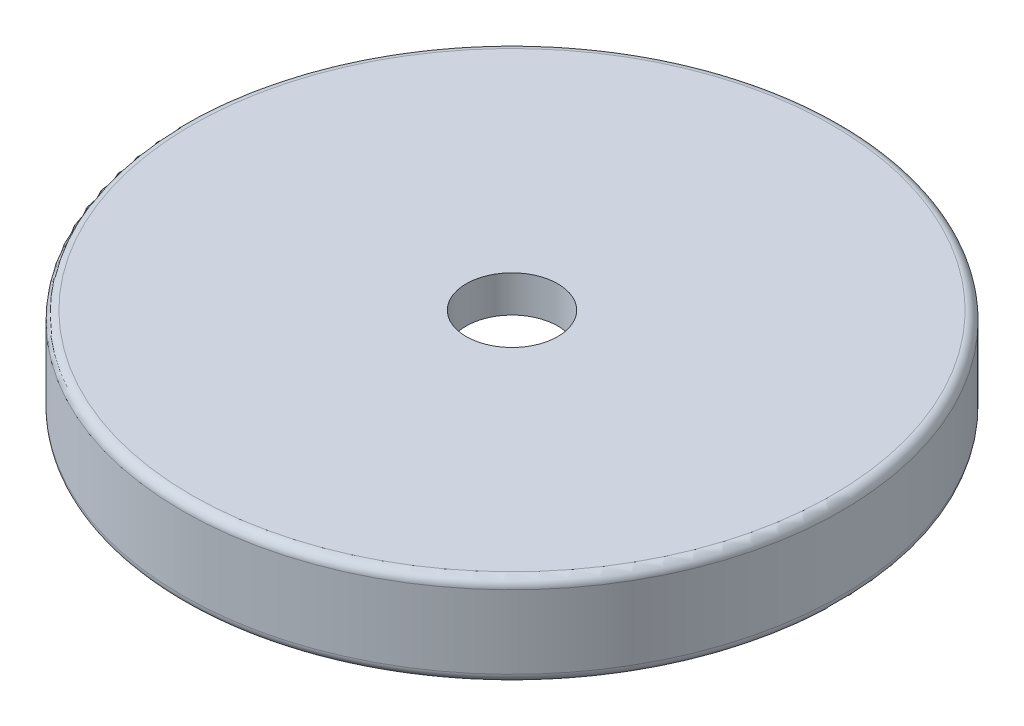
ISO-10303-21;
HEADER;
FILE_DESCRIPTION(('STEP AP214'),'2;1');
FILE_NAME('part.step','',(''),(''),'','','');
FILE_SCHEMA(('AUTOMOTIVE_DESIGN { 1 0 10303 214 1 1 1 1 }'));
ENDSEC;
DATA;
#1=APPLICATION_CONTEXT('core data for automotive mechanical design processes');
#2=APPLICATION_PROTOCOL_DEFINITION('international standard','automotive_design',2000,#1);
#3=PRODUCT_CONTEXT('',#1,'mechanical');
#4=PRODUCT('Part','Part','',(#3));
#5=PRODUCT_RELATED_PRODUCT_CATEGORY('part','',(#4));
#6=PRODUCT_DEFINITION_FORMATION('','',#4);
#7=PRODUCT_DEFINITION_CONTEXT('part definition',#1,'design');
#8=PRODUCT_DEFINITION('design','',#6,#7);
#9=PRODUCT_DEFINITION_SHAPE('','',#8);
#10=(LENGTH_UNIT() NAMED_UNIT(*) SI_UNIT(.MILLI.,.METRE.));
#11=(NAMED_UNIT(*) PLANE_ANGLE_UNIT() SI_UNIT($,.RADIAN.));
#12=(NAMED_UNIT(*) SI_UNIT($,.STERADIAN.) SOLID_ANGLE_UNIT());
#13=UNCERTAINTY_MEASURE_WITH_UNIT(LENGTH_MEASURE(1.E-05),#10,'distance_accuracy_value','');
#14=(GEOMETRIC_REPRESENTATION_CONTEXT(3) GLOBAL_UNCERTAINTY_ASSIGNED_CONTEXT((#13)) GLOBAL_UNIT_ASSIGNED_CONTEXT((#10,
#11,#12)) REPRESENTATION_CONTEXT('',''));
#15=CARTESIAN_POINT('',(0.,0.,0.));
#16=DIRECTION('',(0.,0.,1.));
#17=DIRECTION('',(1.,0.,0.));
#18=AXIS2_PLACEMENT_3D('',#15,#16,#17);
#19=CARTESIAN_POINT('',(0.,0.,0.));
#20=DIRECTION('',(0.,1.,0.));
#21=DIRECTION('',(0.,0.,1.));
#22=AXIS2_PLACEMENT_3D('',#19,#20,#21);
#23=PLANE('',#22);
#24=CARTESIAN_POINT('',(0.,0.,0.));
#25=DIRECTION('',(0.,1.,0.));
#26=DIRECTION('',(0.,0.,1.));
#27=AXIS2_PLACEMENT_3D('',#24,#25,#26);
#28=CIRCLE('',#27,2.5);
#29=CARTESIAN_POINT('',(0.,0.,2.5));
#30=VERTEX_POINT('',#29);
#31=EDGE_CURVE('E66',#30,#30,#28,.T.);
#32=ORIENTED_EDGE('',*,*,#31,.T.);
#33=EDGE_LOOP('',(#32));
#34=FACE_BOUND('',#33,.T.);
#35=CARTESIAN_POINT('',(0.,0.,0.));
#36=DIRECTION('',(0.,-1.,0.));
#37=DIRECTION('',(0.,0.,-1.));
#38=AXIS2_PLACEMENT_3D('',#35,#36,#37);
#39=CIRCLE('',#38,15.);
#40=CARTESIAN_POINT('',(0.,0.,-15.));
#41=VERTEX_POINT('',#40);
#42=EDGE_CURVE('E69',#41,#41,#39,.T.);
#43=ORIENTED_EDGE('',*,*,#42,.T.);
#44=EDGE_LOOP('',(#43));
#45=FACE_BOUND('',#44,.T.);
#46=ADVANCED_FACE('F33',(#34,#45),#23,.F.);
#47=CARTESIAN_POINT('',(0.,2.,0.));
#48=DIRECTION('',(0.,1.,0.));
#49=DIRECTION('',(0.,0.,1.));
#50=AXIS2_PLACEMENT_3D('',#47,#48,#49);
#51=PLANE('',#50);
#52=CARTESIAN_POINT('',(0.,2.,0.));
#53=DIRECTION('',(0.,1.,0.));
#54=DIRECTION('',(0.,0.,1.));
#55=AXIS2_PLACEMENT_3D('',#52,#53,#54);
#56=CIRCLE('',#55,17.5);
#57=CARTESIAN_POINT('',(0.,2.,17.5));
#58=VERTEX_POINT('',#57);
#59=EDGE_CURVE('E48',#58,#58,#56,.T.);
#60=ORIENTED_EDGE('',*,*,#59,.T.);
#61=EDGE_LOOP('',(#60));
#62=FACE_BOUND('',#61,.T.);
#63=CARTESIAN_POINT('',(0.,2.,0.));
#64=DIRECTION('',(0.,1.,0.));
#65=DIRECTION('',(0.,0.,1.));
#66=AXIS2_PLACEMENT_3D('',#63,#64,#65);
#67=CIRCLE('',#66,2.5);
#68=CARTESIAN_POINT('',(0.,2.,2.5));
#69=VERTEX_POINT('',#68);
#70=EDGE_CURVE('E65',#69,#69,#67,.T.);
#71=ORIENTED_EDGE('',*,*,#70,.F.);
#72=EDGE_LOOP('',(#71));
#73=FACE_BOUND('',#72,.T.);
#74=ADVANCED_FACE('F92',(#62,#73),#51,.T.);
#75=CARTESIAN_POINT('',(0.,2.,0.));
#76=DIRECTION('',(0.,-1.,0.));
#77=DIRECTION('',(0.,0.,-1.));
#78=AXIS2_PLACEMENT_3D('',#75,#76,#77);
#79=CYLINDRICAL_SURFACE('',#78,18.);
#80=CARTESIAN_POINT('',(0.,1.5,0.));
#81=DIRECTION('',(0.,1.,0.));
#82=DIRECTION('',(0.,0.,1.));
#83=AXIS2_PLACEMENT_3D('',#80,#81,#82);
#84=CIRCLE('',#83,18.);
#85=CARTESIAN_POINT('',(0.,1.5,18.));
#86=VERTEX_POINT('',#85);
#87=EDGE_CURVE('E44',#86,#86,#84,.F.);
#88=ORIENTED_EDGE('',*,*,#87,.T.);
#89=EDGE_LOOP('',(#88));
#90=FACE_BOUND('',#89,.T.);
#91=CARTESIAN_POINT('',(0.,-2.5,0.));
#92=DIRECTION('',(0.,-1.,0.));
#93=DIRECTION('',(0.,0.,-1.));
#94=AXIS2_PLACEMENT_3D('',#91,#92,#93);
#95=CIRCLE('',#94,18.);
#96=CARTESIAN_POINT('',(0.,-2.5,-18.));
#97=VERTEX_POINT('',#96);
#98=EDGE_CURVE('E53',#97,#97,#95,.F.);
#99=ORIENTED_EDGE('',*,*,#98,.T.);
#100=EDGE_LOOP('',(#99));
#101=FACE_BOUND('',#100,.T.);
#102=ADVANCED_FACE('F98',(#90,#101),#79,.T.);
#103=CARTESIAN_POINT('',(0.,2.,0.));
#104=DIRECTION('',(0.,-1.,0.));
#105=DIRECTION('',(0.,0.,-1.));
#106=AXIS2_PLACEMENT_3D('',#103,#104,#105);
#107=CYLINDRICAL_SURFACE('',#106,2.5);
#108=ORIENTED_EDGE('',*,*,#70,.T.);
#109=EDGE_LOOP('',(#108));
#110=FACE_BOUND('',#109,.T.);
#111=ORIENTED_EDGE('',*,*,#31,.F.);
#112=EDGE_LOOP('',(#111));
#113=FACE_BOUND('',#112,.T.);
#114=ADVANCED_FACE('F104',(#110,#113),#107,.F.);
#115=CARTESIAN_POINT('',(0.,-3.,0.));
#116=DIRECTION('',(0.,-1.,0.));
#117=DIRECTION('',(0.,0.,-1.));
#118=AXIS2_PLACEMENT_3D('',#115,#116,#117);
#119=PLANE('',#118);
#120=CARTESIAN_POINT('',(0.,-3.,0.));
#121=DIRECTION('',(0.,-1.,0.));
#122=DIRECTION('',(0.,0.,-1.));
#123=AXIS2_PLACEMENT_3D('',#120,#121,#122);
#124=CIRCLE('',#123,15.1);
#125=CARTESIAN_POINT('',(0.,-3.,-15.1));
#126=VERTEX_POINT('',#125);
#127=EDGE_CURVE('E10',#126,#126,#124,.F.);
#128=ORIENTED_EDGE('',*,*,#127,.T.);
#129=EDGE_LOOP('',(#128));
#130=FACE_BOUND('',#129,.T.);
#131=CARTESIAN_POINT('',(0.,-3.,0.));
#132=DIRECTION('',(0.,-1.,0.));
#133=DIRECTION('',(0.,0.,-1.));
#134=AXIS2_PLACEMENT_3D('',#131,#132,#133);
#135=CIRCLE('',#134,17.5);
#136=CARTESIAN_POINT('',(0.,-3.,-17.5));
#137=VERTEX_POINT('',#136);
#138=EDGE_CURVE('E56',#137,#137,#135,.T.);
#139=ORIENTED_EDGE('',*,*,#138,.T.);
#140=EDGE_LOOP('',(#139));
#141=FACE_BOUND('',#140,.T.);
#142=ADVANCED_FACE('F89',(#130,#141),#119,.T.);
#143=CARTESIAN_POINT('',(0.,-3.,0.));
#144=DIRECTION('',(0.,1.,0.));
#145=DIRECTION('',(0.,0.,1.));
#146=AXIS2_PLACEMENT_3D('',#143,#144,#145);
#147=CYLINDRICAL_SURFACE('',#146,15.);
#148=CARTESIAN_POINT('',(0.,-2.9,0.));
#149=DIRECTION('',(0.,-1.,0.));
#150=DIRECTION('',(0.,0.,-1.));
#151=AXIS2_PLACEMENT_3D('',#148,#149,#150);
#152=CIRCLE('',#151,15.);
#153=CARTESIAN_POINT('',(0.,-2.9,-15.));
#154=VERTEX_POINT('',#153);
#155=EDGE_CURVE('E40',#154,#154,#152,.T.);
#156=ORIENTED_EDGE('',*,*,#155,.T.);
#157=EDGE_LOOP('',(#156));
#158=FACE_BOUND('',#157,.T.);
#159=CARTESIAN_POINT('',(0.,-2.4142135623731,0.));
#160=DIRECTION('',(0.,1.,0.));
#161=DIRECTION('',(0.,0.,1.));
#162=AXIS2_PLACEMENT_3D('',#159,#160,#161);
#163=CIRCLE('',#162,15.);
#164=CARTESIAN_POINT('',(0.,-2.4142135623731,15.));
#165=VERTEX_POINT('',#164);
#166=EDGE_CURVE('E59',#165,#165,#163,.T.);
#167=ORIENTED_EDGE('',*,*,#166,.T.);
#168=EDGE_LOOP('',(#167));
#169=FACE_BOUND('',#168,.T.);
#170=ADVANCED_FACE('F79',(#158,#169),#147,.F.);
#171=CARTESIAN_POINT('',(0.,-1.,0.));
#172=DIRECTION('',(0.,-1.,0.));
#173=DIRECTION('',(0.,0.,-1.));
#174=AXIS2_PLACEMENT_3D('',#171,#172,#173);
#175=TOROIDAL_SURFACE('',#174,15.,1.);
#176=CARTESIAN_POINT('',(0.,-1.94280904158154,0.));
#177=DIRECTION('',(0.,1.,0.));
#178=DIRECTION('',(0.,0.,1.));
#179=AXIS2_PLACEMENT_3D('',#176,#177,#178);
#180=CIRCLE('',#179,15.3333333333331);
#181=CARTESIAN_POINT('',(0.,-1.94280904158154,15.3333333333331));
#182=VERTEX_POINT('',#181);
#183=EDGE_CURVE('E62',#182,#182,#180,.F.);
#184=ORIENTED_EDGE('',*,*,#183,.T.);
#185=EDGE_LOOP('',(#184));
#186=FACE_BOUND('',#185,.T.);
#187=ORIENTED_EDGE('',*,*,#42,.F.);
#188=EDGE_LOOP('',(#187));
#189=FACE_BOUND('',#188,.T.);
#190=ADVANCED_FACE('F76',(#186,#189),#175,.F.);
#191=CARTESIAN_POINT('',(0.,-2.4142135623731,0.));
#192=DIRECTION('',(0.,1.,0.));
#193=DIRECTION('',(0.,0.,1.));
#194=AXIS2_PLACEMENT_3D('',#191,#192,#193);
#195=TOROIDAL_SURFACE('',#194,15.5,0.5);
#196=ORIENTED_EDGE('',*,*,#166,.F.);
#197=EDGE_LOOP('',(#196));
#198=FACE_BOUND('',#197,.T.);
#199=ORIENTED_EDGE('',*,*,#183,.F.);
#200=EDGE_LOOP('',(#199));
#201=FACE_BOUND('',#200,.T.);
#202=ADVANCED_FACE('F78',(#198,#201),#195,.T.);
#203=CARTESIAN_POINT('',(0.,-2.5,0.));
#204=DIRECTION('',(0.,-1.,0.));
#205=DIRECTION('',(0.,0.,-1.));
#206=AXIS2_PLACEMENT_3D('',#203,#204,#205);
#207=TOROIDAL_SURFACE('',#206,17.5,0.5);
#208=ORIENTED_EDGE('',*,*,#98,.F.);
#209=EDGE_LOOP('',(#208));
#210=FACE_BOUND('',#209,.T.);
#211=ORIENTED_EDGE('',*,*,#138,.F.);
#212=EDGE_LOOP('',(#211));
#213=FACE_BOUND('',#212,.T.);
#214=ADVANCED_FACE('F86',(#210,#213),#207,.T.);
#215=CARTESIAN_POINT('',(0.,1.5,0.));
#216=DIRECTION('',(0.,1.,0.));
#217=DIRECTION('',(0.,0.,1.));
#218=AXIS2_PLACEMENT_3D('',#215,#216,#217);
#219=TOROIDAL_SURFACE('',#218,17.5,0.5);
#220=ORIENTED_EDGE('',*,*,#87,.F.);
#221=EDGE_LOOP('',(#220));
#222=FACE_BOUND('',#221,.T.);
#223=ORIENTED_EDGE('',*,*,#59,.F.);
#224=EDGE_LOOP('',(#223));
#225=FACE_BOUND('',#224,.T.);
#226=ADVANCED_FACE('F108',(#222,#225),#219,.T.);
#227=CARTESIAN_POINT('',(0.,-2.9,0.));
#228=DIRECTION('',(0.,-1.,0.));
#229=DIRECTION('',(0.,0.,-1.));
#230=AXIS2_PLACEMENT_3D('',#227,#228,#229);
#231=TOROIDAL_SURFACE('',#230,15.1,0.1);
#232=ORIENTED_EDGE('',*,*,#127,.F.);
#233=EDGE_LOOP('',(#232));
#234=FACE_BOUND('',#233,.T.);
#235=ORIENTED_EDGE('',*,*,#155,.F.);
#236=EDGE_LOOP('',(#235));
#237=FACE_BOUND('',#236,.T.);
#238=ADVANCED_FACE('F35',(#234,#237),#231,.T.);
#239=CLOSED_SHELL('',(#46,#74,#102,#114,#142,#170,#190,#202,#214,#226,#238));
#240=MANIFOLD_SOLID_BREP('B2',#239);
#241=ADVANCED_BREP_SHAPE_REPRESENTATION('',(#18,#240),#14);
#242=SHAPE_DEFINITION_REPRESENTATION(#9,#241);
ENDSEC;
END-ISO-10303-21;
